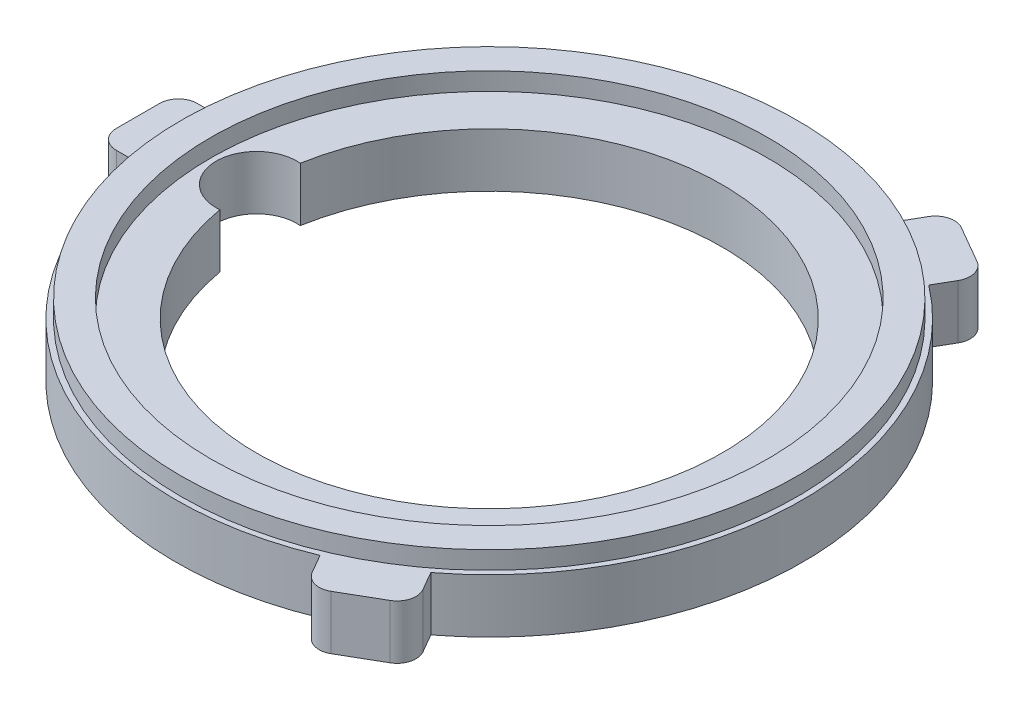
ISO-10303-21;
HEADER;
FILE_DESCRIPTION(('STEP AP214'),'2;1');
FILE_NAME('part.step','',(''),(''),'','','');
FILE_SCHEMA(('AUTOMOTIVE_DESIGN { 1 0 10303 214 1 1 1 1 }'));
ENDSEC;
DATA;
#1=APPLICATION_CONTEXT('core data for automotive mechanical design processes');
#2=APPLICATION_PROTOCOL_DEFINITION('international standard','automotive_design',2000,#1);
#3=PRODUCT_CONTEXT('',#1,'mechanical');
#4=PRODUCT('Part','Part','',(#3));
#5=PRODUCT_RELATED_PRODUCT_CATEGORY('part','',(#4));
#6=PRODUCT_DEFINITION_FORMATION('','',#4);
#7=PRODUCT_DEFINITION_CONTEXT('part definition',#1,'design');
#8=PRODUCT_DEFINITION('design','',#6,#7);
#9=PRODUCT_DEFINITION_SHAPE('','',#8);
#10=(LENGTH_UNIT() NAMED_UNIT(*) SI_UNIT(.MILLI.,.METRE.));
#11=(NAMED_UNIT(*) PLANE_ANGLE_UNIT() SI_UNIT($,.RADIAN.));
#12=(NAMED_UNIT(*) SI_UNIT($,.STERADIAN.) SOLID_ANGLE_UNIT());
#13=UNCERTAINTY_MEASURE_WITH_UNIT(LENGTH_MEASURE(1.E-05),#10,'distance_accuracy_value','');
#14=(GEOMETRIC_REPRESENTATION_CONTEXT(3) GLOBAL_UNCERTAINTY_ASSIGNED_CONTEXT((#13)) GLOBAL_UNIT_ASSIGNED_CONTEXT((#10,
#11,#12)) REPRESENTATION_CONTEXT('',''));
#15=CARTESIAN_POINT('',(0.,0.,0.));
#16=DIRECTION('',(0.,0.,1.));
#17=DIRECTION('',(1.,0.,0.));
#18=AXIS2_PLACEMENT_3D('',#15,#16,#17);
#19=CARTESIAN_POINT('',(0.,1.,0.));
#20=DIRECTION('',(0.,1.,0.));
#21=DIRECTION('',(0.,0.,1.));
#22=AXIS2_PLACEMENT_3D('',#19,#20,#21);
#23=PLANE('',#22);
#24=CARTESIAN_POINT('',(-4.30497406232469,1.,0.));
#25=DIRECTION('',(0.,1.,0.));
#26=DIRECTION('',(0.,0.,1.));
#27=AXIS2_PLACEMENT_3D('',#24,#25,#26);
#28=CIRCLE('',#27,0.747652736910806);
#29=CARTESIAN_POINT('',(-4.2400509516488,1.,-0.744828574042636));
#30=VERTEX_POINT('',#29);
#31=CARTESIAN_POINT('',(-4.2400509516488,1.,0.744828574042636));
#32=VERTEX_POINT('',#31);
#33=EDGE_CURVE('E228',#30,#32,#28,.T.);
#34=ORIENTED_EDGE('',*,*,#33,.F.);
#35=CARTESIAN_POINT('',(0.,1.,0.));
#36=DIRECTION('',(0.,1.,0.));
#37=DIRECTION('',(0.,0.,1.));
#38=AXIS2_PLACEMENT_3D('',#35,#36,#37);
#39=CIRCLE('',#38,4.30497406232469);
#40=EDGE_CURVE('E232',#32,#30,#39,.T.);
#41=ORIENTED_EDGE('',*,*,#40,.F.);
#42=EDGE_LOOP('',(#34,#41));
#43=FACE_BOUND('',#42,.T.);
#44=CARTESIAN_POINT('',(0.,1.,0.));
#45=DIRECTION('',(0.,1.,0.));
#46=DIRECTION('',(0.,0.,1.));
#47=AXIS2_PLACEMENT_3D('',#44,#45,#46);
#48=CIRCLE('',#47,5.1526268);
#49=CARTESIAN_POINT('',(0.,1.,5.1526268));
#50=VERTEX_POINT('',#49);
#51=EDGE_CURVE('E11',#50,#50,#48,.F.);
#52=ORIENTED_EDGE('',*,*,#51,.F.);
#53=EDGE_LOOP('',(#52));
#54=FACE_BOUND('',#53,.T.);
#55=ADVANCED_FACE('F33',(#43,#54),#23,.T.);
#56=CARTESIAN_POINT('',(0.,1.,0.));
#57=DIRECTION('',(0.,-1.,0.));
#58=DIRECTION('',(0.,0.,-1.));
#59=AXIS2_PLACEMENT_3D('',#56,#57,#58);
#60=CYLINDRICAL_SURFACE('',#59,5.8);
#61=DIRECTION('',(0.,-1.,0.));
#62=VECTOR('',#61,1.);
#63=CARTESIAN_POINT('',(2.22613304712086,1.,-5.35577554202156));
#64=LINE('',#63,#62);
#65=CARTESIAN_POINT('',(2.22613304712086,0.,-5.35577554202156));
#66=VERTEX_POINT('',#65);
#67=CARTESIAN_POINT('',(2.22613304712086,1.,-5.35577554202156));
#68=VERTEX_POINT('',#67);
#69=EDGE_CURVE('E177',#66,#68,#64,.F.);
#70=ORIENTED_EDGE('',*,*,#69,.F.);
#71=CARTESIAN_POINT('',(0.,0.,0.));
#72=DIRECTION('',(0.,1.,0.));
#73=DIRECTION('',(0.,0.,1.));
#74=AXIS2_PLACEMENT_3D('',#71,#72,#73);
#75=CIRCLE('',#74,5.8);
#76=CARTESIAN_POINT('',(-5.75130419991848,0.,-0.75));
#77=VERTEX_POINT('',#76);
#78=EDGE_CURVE('E185',#66,#77,#75,.T.);
#79=ORIENTED_EDGE('',*,*,#78,.T.);
#80=DIRECTION('',(0.,-1.,0.));
#81=VECTOR('',#80,1.);
#82=CARTESIAN_POINT('',(-5.75130419991848,1.,-0.75));
#83=LINE('',#82,#81);
#84=CARTESIAN_POINT('',(-5.75130419991848,1.,-0.75));
#85=VERTEX_POINT('',#84);
#86=EDGE_CURVE('E246',#77,#85,#83,.F.);
#87=ORIENTED_EDGE('',*,*,#86,.T.);
#88=CARTESIAN_POINT('',(0.,1.,0.));
#89=DIRECTION('',(0.,1.,0.));
#90=DIRECTION('',(0.,0.,1.));
#91=AXIS2_PLACEMENT_3D('',#88,#89,#90);
#92=CIRCLE('',#91,5.8);
#93=EDGE_CURVE('E201',#68,#85,#92,.T.);
#94=ORIENTED_EDGE('',*,*,#93,.F.);
#95=EDGE_LOOP('',(#70,#79,#87,#94));
#96=FACE_BOUND('',#95,.T.);
#97=ADVANCED_FACE('F199',(#96),#60,.T.);
#98=CARTESIAN_POINT('',(3.52517115279759,0.,4.60577554202153));
#99=VERTEX_POINT('',#98);
#100=CARTESIAN_POINT('',(3.52517115279753,0.,-4.60577554202158));
#101=VERTEX_POINT('',#100);
#102=EDGE_CURVE('E194',#99,#101,#75,.T.);
#103=ORIENTED_EDGE('',*,*,#102,.T.);
#104=DIRECTION('',(0.,-1.,0.));
#105=VECTOR('',#104,1.);
#106=CARTESIAN_POINT('',(3.52517115279753,1.,-4.60577554202158));
#107=LINE('',#106,#105);
#108=CARTESIAN_POINT('',(3.52517115279753,1.,-4.60577554202158));
#109=VERTEX_POINT('',#108);
#110=EDGE_CURVE('E203',#101,#109,#107,.F.);
#111=ORIENTED_EDGE('',*,*,#110,.T.);
#112=CARTESIAN_POINT('',(3.52517115279759,1.,4.60577554202153));
#113=VERTEX_POINT('',#112);
#114=EDGE_CURVE('E258',#113,#109,#92,.T.);
#115=ORIENTED_EDGE('',*,*,#114,.F.);
#116=DIRECTION('',(0.,-1.,0.));
#117=VECTOR('',#116,1.);
#118=CARTESIAN_POINT('',(3.52517115279759,1.,4.60577554202153));
#119=LINE('',#118,#117);
#120=EDGE_CURVE('E225',#99,#113,#119,.F.);
#121=ORIENTED_EDGE('',*,*,#120,.F.);
#122=EDGE_LOOP('',(#103,#111,#115,#121));
#123=FACE_BOUND('',#122,.T.);
#124=ADVANCED_FACE('F364',(#123),#60,.T.);
#125=CARTESIAN_POINT('',(-5.75130419991848,0.,0.75));
#126=VERTEX_POINT('',#125);
#127=CARTESIAN_POINT('',(2.22613304712094,0.,5.35577554202153));
#128=VERTEX_POINT('',#127);
#129=EDGE_CURVE('E197',#126,#128,#75,.T.);
#130=ORIENTED_EDGE('',*,*,#129,.T.);
#131=DIRECTION('',(0.,-1.,0.));
#132=VECTOR('',#131,1.);
#133=CARTESIAN_POINT('',(2.22613304712094,1.,5.35577554202153));
#134=LINE('',#133,#132);
#135=CARTESIAN_POINT('',(2.22613304712094,1.,5.35577554202153));
#136=VERTEX_POINT('',#135);
#137=EDGE_CURVE('E219',#128,#136,#134,.F.);
#138=ORIENTED_EDGE('',*,*,#137,.T.);
#139=CARTESIAN_POINT('',(-5.75130419991848,1.,0.75));
#140=VERTEX_POINT('',#139);
#141=EDGE_CURVE('E255',#140,#136,#92,.T.);
#142=ORIENTED_EDGE('',*,*,#141,.F.);
#143=DIRECTION('',(0.,-1.,0.));
#144=VECTOR('',#143,1.);
#145=CARTESIAN_POINT('',(-5.75130419991848,1.,0.75));
#146=LINE('',#145,#144);
#147=EDGE_CURVE('E195',#126,#140,#146,.F.);
#148=ORIENTED_EDGE('',*,*,#147,.F.);
#149=EDGE_LOOP('',(#130,#138,#142,#148));
#150=FACE_BOUND('',#149,.T.);
#151=ADVANCED_FACE('F337',(#150),#60,.T.);
#152=CARTESIAN_POINT('',(0.,1.,0.));
#153=DIRECTION('',(0.,1.,0.));
#154=DIRECTION('',(0.,0.,1.));
#155=AXIS2_PLACEMENT_3D('',#152,#153,#154);
#156=CIRCLE('',#155,5.7);
#157=CARTESIAN_POINT('',(0.,1.,5.7));
#158=VERTEX_POINT('',#157);
#159=EDGE_CURVE('E383',#158,#158,#156,.T.);
#160=ORIENTED_EDGE('',*,*,#159,.F.);
#161=EDGE_LOOP('',(#160));
#162=FACE_BOUND('',#161,.T.);
#163=DIRECTION('',(-0.500000000000004,0.,-0.866025403784436));
#164=VECTOR('',#163,1.);
#165=CARTESIAN_POINT('',(2.6004809471617,1.,6.00416512459884));
#166=LINE('',#165,#164);
#167=CARTESIAN_POINT('',(2.4254809471617,1.,5.70105623327429));
#168=VERTEX_POINT('',#167);
#169=EDGE_CURVE('E218',#168,#136,#166,.T.);
#170=ORIENTED_EDGE('',*,*,#169,.F.);
#171=CARTESIAN_POINT('',(2.72858983848625,1.,5.52605623327429));
#172=DIRECTION('',(0.,1.,0.));
#173=DIRECTION('',(0.,0.,1.));
#174=AXIS2_PLACEMENT_3D('',#171,#172,#173);
#175=CIRCLE('',#174,0.35);
#176=CARTESIAN_POINT('',(2.90358983848625,1.,5.82916512459884));
#177=VERTEX_POINT('',#176);
#178=EDGE_CURVE('E293',#168,#177,#175,.T.);
#179=ORIENTED_EDGE('',*,*,#178,.T.);
#180=DIRECTION('',(0.866025403784436,0.,-0.500000000000004));
#181=VECTOR('',#180,1.);
#182=CARTESIAN_POINT('',(2.6004809471617,1.,6.00416512459884));
#183=LINE('',#182,#181);
#184=CARTESIAN_POINT('',(3.5964101615138,1.,5.42916512459884));
#185=VERTEX_POINT('',#184);
#186=EDGE_CURVE('E213',#177,#185,#183,.T.);
#187=ORIENTED_EDGE('',*,*,#186,.T.);
#188=CARTESIAN_POINT('',(3.4214101615138,1.,5.12605623327428));
#189=DIRECTION('',(0.,1.,0.));
#190=DIRECTION('',(0.,0.,1.));
#191=AXIS2_PLACEMENT_3D('',#188,#189,#190);
#192=CIRCLE('',#191,0.35);
#193=CARTESIAN_POINT('',(3.72451905283835,1.,4.95105623327428));
#194=VERTEX_POINT('',#193);
#195=EDGE_CURVE('E48',#185,#194,#192,.T.);
#196=ORIENTED_EDGE('',*,*,#195,.T.);
#197=DIRECTION('',(-0.500000000000004,0.,-0.866025403784436));
#198=VECTOR('',#197,1.);
#199=CARTESIAN_POINT('',(3.89951905283835,1.,5.25416512459883));
#200=LINE('',#199,#198);
#201=EDGE_CURVE('E215',#194,#113,#200,.T.);
#202=ORIENTED_EDGE('',*,*,#201,.T.);
#203=ORIENTED_EDGE('',*,*,#114,.T.);
#204=DIRECTION('',(-0.499999999999992,0.,0.866025403784443));
#205=VECTOR('',#204,1.);
#206=CARTESIAN_POINT('',(3.89951905283828,1.,-5.25416512459889));
#207=LINE('',#206,#205);
#208=CARTESIAN_POINT('',(3.72451905283828,1.,-4.95105623327433));
#209=VERTEX_POINT('',#208);
#210=EDGE_CURVE('E209',#209,#109,#207,.T.);
#211=ORIENTED_EDGE('',*,*,#210,.F.);
#212=CARTESIAN_POINT('',(3.42141016151373,1.,-5.12605623327433));
#213=DIRECTION('',(0.,1.,0.));
#214=DIRECTION('',(0.,0.,1.));
#215=AXIS2_PLACEMENT_3D('',#212,#213,#214);
#216=CIRCLE('',#215,0.35);
#217=CARTESIAN_POINT('',(3.59641016151373,1.,-5.42916512459888));
#218=VERTEX_POINT('',#217);
#219=EDGE_CURVE('E290',#209,#218,#216,.T.);
#220=ORIENTED_EDGE('',*,*,#219,.T.);
#221=DIRECTION('',(-0.866025403784443,0.,-0.499999999999992));
#222=VECTOR('',#221,1.);
#223=CARTESIAN_POINT('',(3.89951905283828,1.,-5.25416512459889));
#224=LINE('',#223,#222);
#225=CARTESIAN_POINT('',(2.90358983848617,1.,-5.82916512459888));
#226=VERTEX_POINT('',#225);
#227=EDGE_CURVE('E373',#218,#226,#224,.T.);
#228=ORIENTED_EDGE('',*,*,#227,.T.);
#229=CARTESIAN_POINT('',(2.72858983848617,1.,-5.52605623327432));
#230=DIRECTION('',(0.,1.,0.));
#231=DIRECTION('',(0.,0.,1.));
#232=AXIS2_PLACEMENT_3D('',#229,#230,#231);
#233=CIRCLE('',#232,0.35);
#234=CARTESIAN_POINT('',(2.42548094716162,1.,-5.70105623327432));
#235=VERTEX_POINT('',#234);
#236=EDGE_CURVE('E288',#226,#235,#233,.T.);
#237=ORIENTED_EDGE('',*,*,#236,.T.);
#238=DIRECTION('',(-0.499999999999992,0.,0.866025403784443));
#239=VECTOR('',#238,1.);
#240=CARTESIAN_POINT('',(2.60048094716162,1.,-6.00416512459888));
#241=LINE('',#240,#239);
#242=EDGE_CURVE('E371',#235,#68,#241,.T.);
#243=ORIENTED_EDGE('',*,*,#242,.T.);
#244=ORIENTED_EDGE('',*,*,#93,.T.);
#245=DIRECTION('',(1.,0.,0.));
#246=VECTOR('',#245,1.);
#247=CARTESIAN_POINT('',(-6.5,1.,-0.75));
#248=LINE('',#247,#246);
#249=CARTESIAN_POINT('',(-6.15,1.,-0.75));
#250=VERTEX_POINT('',#249);
#251=EDGE_CURVE('E244',#250,#85,#248,.T.);
#252=ORIENTED_EDGE('',*,*,#251,.F.);
#253=CARTESIAN_POINT('',(-6.15,1.,-0.4));
#254=DIRECTION('',(0.,1.,0.));
#255=DIRECTION('',(0.,0.,1.));
#256=AXIS2_PLACEMENT_3D('',#253,#254,#255);
#257=CIRCLE('',#256,0.35);
#258=CARTESIAN_POINT('',(-6.5,1.,-0.4));
#259=VERTEX_POINT('',#258);
#260=EDGE_CURVE('E285',#250,#259,#257,.T.);
#261=ORIENTED_EDGE('',*,*,#260,.T.);
#262=DIRECTION('',(0.,0.,1.));
#263=VECTOR('',#262,1.);
#264=CARTESIAN_POINT('',(-6.5,1.,-0.75));
#265=LINE('',#264,#263);
#266=CARTESIAN_POINT('',(-6.5,1.,0.4));
#267=VERTEX_POINT('',#266);
#268=EDGE_CURVE('E240',#259,#267,#265,.T.);
#269=ORIENTED_EDGE('',*,*,#268,.T.);
#270=CARTESIAN_POINT('',(-6.15,1.,0.4));
#271=DIRECTION('',(0.,1.,0.));
#272=DIRECTION('',(0.,0.,1.));
#273=AXIS2_PLACEMENT_3D('',#270,#271,#272);
#274=CIRCLE('',#273,0.35);
#275=CARTESIAN_POINT('',(-6.15,1.,0.75));
#276=VERTEX_POINT('',#275);
#277=EDGE_CURVE('E55',#267,#276,#274,.T.);
#278=ORIENTED_EDGE('',*,*,#277,.T.);
#279=DIRECTION('',(1.,0.,0.));
#280=VECTOR('',#279,1.);
#281=CARTESIAN_POINT('',(-6.5,1.,0.75));
#282=LINE('',#281,#280);
#283=EDGE_CURVE('E242',#276,#140,#282,.T.);
#284=ORIENTED_EDGE('',*,*,#283,.T.);
#285=ORIENTED_EDGE('',*,*,#141,.T.);
#286=EDGE_LOOP('',(#170,#179,#187,#196,#202,#203,#211,#220,#228,#237,#243,#244,#252,#261,#269,
#278,#284,#285));
#287=FACE_BOUND('',#286,.T.);
#288=ADVANCED_FACE('F320',(#162,#287),#23,.T.);
#289=CARTESIAN_POINT('',(0.,0.,0.));
#290=DIRECTION('',(0.,1.,0.));
#291=DIRECTION('',(0.,0.,1.));
#292=AXIS2_PLACEMENT_3D('',#289,#290,#291);
#293=PLANE('',#292);
#294=DIRECTION('',(0.866025403784436,0.,-0.500000000000004));
#295=VECTOR('',#294,1.);
#296=CARTESIAN_POINT('',(2.6004809471617,0.,6.00416512459884));
#297=LINE('',#296,#295);
#298=CARTESIAN_POINT('',(2.90358983848625,0.,5.82916512459884));
#299=VERTEX_POINT('',#298);
#300=CARTESIAN_POINT('',(3.5964101615138,0.,5.42916512459884));
#301=VERTEX_POINT('',#300);
#302=EDGE_CURVE('E202',#299,#301,#297,.T.);
#303=ORIENTED_EDGE('',*,*,#302,.F.);
#304=CARTESIAN_POINT('',(2.72858983848625,0.,5.52605623327429));
#305=DIRECTION('',(0.,1.,0.));
#306=DIRECTION('',(0.,0.,1.));
#307=AXIS2_PLACEMENT_3D('',#304,#305,#306);
#308=CIRCLE('',#307,0.35);
#309=CARTESIAN_POINT('',(2.4254809471617,0.,5.70105623327429));
#310=VERTEX_POINT('',#309);
#311=EDGE_CURVE('E281',#299,#310,#308,.F.);
#312=ORIENTED_EDGE('',*,*,#311,.T.);
#313=DIRECTION('',(-0.500000000000004,0.,-0.866025403784436));
#314=VECTOR('',#313,1.);
#315=CARTESIAN_POINT('',(2.6004809471617,0.,6.00416512459884));
#316=LINE('',#315,#314);
#317=EDGE_CURVE('E216',#310,#128,#316,.T.);
#318=ORIENTED_EDGE('',*,*,#317,.T.);
#319=ORIENTED_EDGE('',*,*,#129,.F.);
#320=DIRECTION('',(1.,0.,0.));
#321=VECTOR('',#320,1.);
#322=CARTESIAN_POINT('',(-6.5,0.,0.75));
#323=LINE('',#322,#321);
#324=CARTESIAN_POINT('',(-6.15,0.,0.75));
#325=VERTEX_POINT('',#324);
#326=EDGE_CURVE('E249',#325,#126,#323,.T.);
#327=ORIENTED_EDGE('',*,*,#326,.F.);
#328=CARTESIAN_POINT('',(-6.15,0.,0.4));
#329=DIRECTION('',(0.,1.,0.));
#330=DIRECTION('',(0.,0.,1.));
#331=AXIS2_PLACEMENT_3D('',#328,#329,#330);
#332=CIRCLE('',#331,0.35);
#333=CARTESIAN_POINT('',(-6.5,0.,0.4));
#334=VERTEX_POINT('',#333);
#335=EDGE_CURVE('E273',#325,#334,#332,.F.);
#336=ORIENTED_EDGE('',*,*,#335,.T.);
#337=DIRECTION('',(0.,0.,1.));
#338=VECTOR('',#337,1.);
#339=CARTESIAN_POINT('',(-6.5,0.,-0.75));
#340=LINE('',#339,#338);
#341=CARTESIAN_POINT('',(-6.5,0.,-0.4));
#342=VERTEX_POINT('',#341);
#343=EDGE_CURVE('E237',#342,#334,#340,.T.);
#344=ORIENTED_EDGE('',*,*,#343,.F.);
#345=CARTESIAN_POINT('',(-6.15,0.,-0.4));
#346=DIRECTION('',(0.,1.,0.));
#347=DIRECTION('',(0.,0.,1.));
#348=AXIS2_PLACEMENT_3D('',#345,#346,#347);
#349=CIRCLE('',#348,0.35);
#350=CARTESIAN_POINT('',(-6.15,0.,-0.75));
#351=VERTEX_POINT('',#350);
#352=EDGE_CURVE('E271',#342,#351,#349,.F.);
#353=ORIENTED_EDGE('',*,*,#352,.T.);
#354=DIRECTION('',(1.,0.,0.));
#355=VECTOR('',#354,1.);
#356=CARTESIAN_POINT('',(-6.5,0.,-0.75));
#357=LINE('',#356,#355);
#358=EDGE_CURVE('E190',#351,#77,#357,.T.);
#359=ORIENTED_EDGE('',*,*,#358,.T.);
#360=ORIENTED_EDGE('',*,*,#78,.F.);
#361=DIRECTION('',(-0.499999999999992,0.,0.866025403784443));
#362=VECTOR('',#361,1.);
#363=CARTESIAN_POINT('',(2.60048094716162,0.,-6.00416512459888));
#364=LINE('',#363,#362);
#365=CARTESIAN_POINT('',(2.42548094716162,0.,-5.70105623327432));
#366=VERTEX_POINT('',#365);
#367=EDGE_CURVE('E172',#366,#66,#364,.T.);
#368=ORIENTED_EDGE('',*,*,#367,.F.);
#369=CARTESIAN_POINT('',(2.72858983848617,0.,-5.52605623327432));
#370=DIRECTION('',(0.,1.,0.));
#371=DIRECTION('',(0.,0.,1.));
#372=AXIS2_PLACEMENT_3D('',#369,#370,#371);
#373=CIRCLE('',#372,0.35);
#374=CARTESIAN_POINT('',(2.90358983848617,0.,-5.82916512459888));
#375=VERTEX_POINT('',#374);
#376=EDGE_CURVE('E275',#366,#375,#373,.F.);
#377=ORIENTED_EDGE('',*,*,#376,.T.);
#378=DIRECTION('',(-0.866025403784443,0.,-0.499999999999992));
#379=VECTOR('',#378,1.);
#380=CARTESIAN_POINT('',(3.89951905283828,0.,-5.25416512459889));
#381=LINE('',#380,#379);
#382=CARTESIAN_POINT('',(3.59641016151373,0.,-5.42916512459888));
#383=VERTEX_POINT('',#382);
#384=EDGE_CURVE('E182',#383,#375,#381,.T.);
#385=ORIENTED_EDGE('',*,*,#384,.F.);
#386=CARTESIAN_POINT('',(3.42141016151373,0.,-5.12605623327433));
#387=DIRECTION('',(0.,1.,0.));
#388=DIRECTION('',(0.,0.,1.));
#389=AXIS2_PLACEMENT_3D('',#386,#387,#388);
#390=CIRCLE('',#389,0.35);
#391=CARTESIAN_POINT('',(3.72451905283828,0.,-4.95105623327433));
#392=VERTEX_POINT('',#391);
#393=EDGE_CURVE('E277',#383,#392,#390,.F.);
#394=ORIENTED_EDGE('',*,*,#393,.T.);
#395=DIRECTION('',(-0.499999999999992,0.,0.866025403784443));
#396=VECTOR('',#395,1.);
#397=CARTESIAN_POINT('',(3.89951905283828,0.,-5.25416512459889));
#398=LINE('',#397,#396);
#399=EDGE_CURVE('E181',#392,#101,#398,.T.);
#400=ORIENTED_EDGE('',*,*,#399,.T.);
#401=ORIENTED_EDGE('',*,*,#102,.F.);
#402=DIRECTION('',(-0.500000000000004,0.,-0.866025403784436));
#403=VECTOR('',#402,1.);
#404=CARTESIAN_POINT('',(3.89951905283835,0.,5.25416512459883));
#405=LINE('',#404,#403);
#406=CARTESIAN_POINT('',(3.72451905283835,0.,4.95105623327428));
#407=VERTEX_POINT('',#406);
#408=EDGE_CURVE('E206',#407,#99,#405,.T.);
#409=ORIENTED_EDGE('',*,*,#408,.F.);
#410=CARTESIAN_POINT('',(3.4214101615138,0.,5.12605623327428));
#411=DIRECTION('',(0.,1.,0.));
#412=DIRECTION('',(0.,0.,1.));
#413=AXIS2_PLACEMENT_3D('',#410,#411,#412);
#414=CIRCLE('',#413,0.35);
#415=EDGE_CURVE('E279',#407,#301,#414,.F.);
#416=ORIENTED_EDGE('',*,*,#415,.T.);
#417=EDGE_LOOP('',(#303,#312,#318,#319,#327,#336,#344,#353,#359,#360,#368,#377,#385,#394,#400,
#401,#409,#416));
#418=FACE_BOUND('',#417,.T.);
#419=CARTESIAN_POINT('',(0.,0.,0.));
#420=DIRECTION('',(0.,1.,0.));
#421=DIRECTION('',(0.,0.,1.));
#422=AXIS2_PLACEMENT_3D('',#419,#420,#421);
#423=CIRCLE('',#422,4.30497406232469);
#424=CARTESIAN_POINT('',(-4.2400509516488,0.,0.744828574042636));
#425=VERTEX_POINT('',#424);
#426=CARTESIAN_POINT('',(-4.2400509516488,0.,-0.744828574042636));
#427=VERTEX_POINT('',#426);
#428=EDGE_CURVE('E234',#425,#427,#423,.T.);
#429=ORIENTED_EDGE('',*,*,#428,.T.);
#430=CARTESIAN_POINT('',(-4.30497406232469,0.,0.));
#431=DIRECTION('',(0.,1.,0.));
#432=DIRECTION('',(0.,0.,1.));
#433=AXIS2_PLACEMENT_3D('',#430,#431,#432);
#434=CIRCLE('',#433,0.747652736910806);
#435=EDGE_CURVE('E229',#427,#425,#434,.T.);
#436=ORIENTED_EDGE('',*,*,#435,.T.);
#437=EDGE_LOOP('',(#429,#436));
#438=FACE_BOUND('',#437,.T.);
#439=ADVANCED_FACE('F187',(#418,#438),#293,.F.);
#440=CARTESIAN_POINT('',(-6.5,1.,0.75));
#441=DIRECTION('',(0.,0.,-1.));
#442=DIRECTION('',(-1.,0.,0.));
#443=AXIS2_PLACEMENT_3D('',#440,#441,#442);
#444=PLANE('',#443);
#445=ORIENTED_EDGE('',*,*,#283,.F.);
#446=DIRECTION('',(0.,-1.,0.));
#447=VECTOR('',#446,1.);
#448=CARTESIAN_POINT('',(-6.15,1.,0.75));
#449=LINE('',#448,#447);
#450=EDGE_CURVE('E306',#276,#325,#449,.T.);
#451=ORIENTED_EDGE('',*,*,#450,.T.);
#452=ORIENTED_EDGE('',*,*,#326,.T.);
#453=ORIENTED_EDGE('',*,*,#147,.T.);
#454=EDGE_LOOP('',(#445,#451,#452,#453));
#455=FACE_BOUND('',#454,.T.);
#456=ADVANCED_FACE('F333',(#455),#444,.F.);
#457=CARTESIAN_POINT('',(-6.5,1.,-0.75));
#458=DIRECTION('',(0.,0.,-1.));
#459=DIRECTION('',(-1.,0.,0.));
#460=AXIS2_PLACEMENT_3D('',#457,#458,#459);
#461=PLANE('',#460);
#462=ORIENTED_EDGE('',*,*,#358,.F.);
#463=DIRECTION('',(0.,-1.,0.));
#464=VECTOR('',#463,1.);
#465=CARTESIAN_POINT('',(-6.15,1.,-0.75));
#466=LINE('',#465,#464);
#467=EDGE_CURVE('E41',#351,#250,#466,.F.);
#468=ORIENTED_EDGE('',*,*,#467,.T.);
#469=ORIENTED_EDGE('',*,*,#251,.T.);
#470=ORIENTED_EDGE('',*,*,#86,.F.);
#471=EDGE_LOOP('',(#462,#468,#469,#470));
#472=FACE_BOUND('',#471,.T.);
#473=ADVANCED_FACE('F316',(#472),#461,.T.);
#474=CARTESIAN_POINT('',(-6.5,1.,-0.75));
#475=DIRECTION('',(1.,0.,0.));
#476=DIRECTION('',(0.,0.,-1.));
#477=AXIS2_PLACEMENT_3D('',#474,#475,#476);
#478=PLANE('',#477);
#479=ORIENTED_EDGE('',*,*,#343,.T.);
#480=DIRECTION('',(0.,-1.,0.));
#481=VECTOR('',#480,1.);
#482=CARTESIAN_POINT('',(-6.5,1.,0.4));
#483=LINE('',#482,#481);
#484=EDGE_CURVE('E312',#334,#267,#483,.F.);
#485=ORIENTED_EDGE('',*,*,#484,.T.);
#486=ORIENTED_EDGE('',*,*,#268,.F.);
#487=DIRECTION('',(0.,-1.,0.));
#488=VECTOR('',#487,1.);
#489=CARTESIAN_POINT('',(-6.5,0.,-0.4));
#490=LINE('',#489,#488);
#491=EDGE_CURVE('E309',#259,#342,#490,.T.);
#492=ORIENTED_EDGE('',*,*,#491,.T.);
#493=EDGE_LOOP('',(#479,#485,#486,#492));
#494=FACE_BOUND('',#493,.T.);
#495=ADVANCED_FACE('F325',(#494),#478,.F.);
#496=CARTESIAN_POINT('',(0.,0.,0.));
#497=DIRECTION('',(0.,1.,0.));
#498=DIRECTION('',(0.,0.,1.));
#499=AXIS2_PLACEMENT_3D('',#496,#497,#498);
#500=CYLINDRICAL_SURFACE('',#499,4.30497406232469);
#501=ORIENTED_EDGE('',*,*,#428,.F.);
#502=DIRECTION('',(0.,1.,0.));
#503=VECTOR('',#502,1.);
#504=CARTESIAN_POINT('',(-4.2400509516488,0.5,0.744828574042636));
#505=LINE('',#504,#503);
#506=EDGE_CURVE('E263',#425,#32,#505,.T.);
#507=ORIENTED_EDGE('',*,*,#506,.T.);
#508=ORIENTED_EDGE('',*,*,#40,.T.);
#509=DIRECTION('',(0.,1.,0.));
#510=VECTOR('',#509,1.);
#511=CARTESIAN_POINT('',(-4.2400509516488,0.5,-0.744828574042636));
#512=LINE('',#511,#510);
#513=EDGE_CURVE('E257',#30,#427,#512,.F.);
#514=ORIENTED_EDGE('',*,*,#513,.T.);
#515=EDGE_LOOP('',(#501,#507,#508,#514));
#516=FACE_BOUND('',#515,.T.);
#517=ADVANCED_FACE('F563',(#516),#500,.F.);
#518=CARTESIAN_POINT('',(-4.30497406232469,0.,0.));
#519=DIRECTION('',(0.,1.,0.));
#520=DIRECTION('',(0.,0.,1.));
#521=AXIS2_PLACEMENT_3D('',#518,#519,#520);
#522=CYLINDRICAL_SURFACE('',#521,0.747652736910806);
#523=ORIENTED_EDGE('',*,*,#435,.F.);
#524=ORIENTED_EDGE('',*,*,#513,.F.);
#525=ORIENTED_EDGE('',*,*,#33,.T.);
#526=ORIENTED_EDGE('',*,*,#506,.F.);
#527=EDGE_LOOP('',(#523,#524,#525,#526));
#528=FACE_BOUND('',#527,.T.);
#529=ADVANCED_FACE('F527',(#528),#522,.F.);
#530=CARTESIAN_POINT('',(3.89951905283835,1.,5.25416512459883));
#531=DIRECTION('',(-0.866025403784436,0.,0.500000000000004));
#532=DIRECTION('',(0.500000000000004,0.,0.866025403784436));
#533=AXIS2_PLACEMENT_3D('',#530,#531,#532);
#534=PLANE('',#533);
#535=ORIENTED_EDGE('',*,*,#201,.F.);
#536=DIRECTION('',(0.,-1.,0.));
#537=VECTOR('',#536,1.);
#538=CARTESIAN_POINT('',(3.72451905283835,1.,4.95105623327428));
#539=LINE('',#538,#537);
#540=EDGE_CURVE('E295',#194,#407,#539,.T.);
#541=ORIENTED_EDGE('',*,*,#540,.T.);
#542=ORIENTED_EDGE('',*,*,#408,.T.);
#543=ORIENTED_EDGE('',*,*,#120,.T.);
#544=EDGE_LOOP('',(#535,#541,#542,#543));
#545=FACE_BOUND('',#544,.T.);
#546=ADVANCED_FACE('F357',(#545),#534,.F.);
#547=CARTESIAN_POINT('',(2.6004809471617,1.,6.00416512459884));
#548=DIRECTION('',(-0.866025403784436,0.,0.500000000000004));
#549=DIRECTION('',(0.500000000000004,0.,0.866025403784436));
#550=AXIS2_PLACEMENT_3D('',#547,#548,#549);
#551=PLANE('',#550);
#552=ORIENTED_EDGE('',*,*,#317,.F.);
#553=DIRECTION('',(0.,-1.,0.));
#554=VECTOR('',#553,1.);
#555=CARTESIAN_POINT('',(2.4254809471617,1.,5.70105623327429));
#556=LINE('',#555,#554);
#557=EDGE_CURVE('E283',#310,#168,#556,.F.);
#558=ORIENTED_EDGE('',*,*,#557,.T.);
#559=ORIENTED_EDGE('',*,*,#169,.T.);
#560=ORIENTED_EDGE('',*,*,#137,.F.);
#561=EDGE_LOOP('',(#552,#558,#559,#560));
#562=FACE_BOUND('',#561,.T.);
#563=ADVANCED_FACE('F341',(#562),#551,.T.);
#564=CARTESIAN_POINT('',(2.6004809471617,1.,6.00416512459884));
#565=DIRECTION('',(-0.500000000000004,0.,-0.866025403784436));
#566=DIRECTION('',(-0.866025403784436,0.,0.500000000000004));
#567=AXIS2_PLACEMENT_3D('',#564,#565,#566);
#568=PLANE('',#567);
#569=ORIENTED_EDGE('',*,*,#186,.F.);
#570=DIRECTION('',(0.,-1.,0.));
#571=VECTOR('',#570,1.);
#572=CARTESIAN_POINT('',(2.90358983848625,0.,5.82916512459884));
#573=LINE('',#572,#571);
#574=EDGE_CURVE('E268',#177,#299,#573,.T.);
#575=ORIENTED_EDGE('',*,*,#574,.T.);
#576=ORIENTED_EDGE('',*,*,#302,.T.);
#577=DIRECTION('',(0.,-1.,0.));
#578=VECTOR('',#577,1.);
#579=CARTESIAN_POINT('',(3.5964101615138,1.,5.42916512459884));
#580=LINE('',#579,#578);
#581=EDGE_CURVE('E266',#301,#185,#580,.F.);
#582=ORIENTED_EDGE('',*,*,#581,.T.);
#583=EDGE_LOOP('',(#569,#575,#576,#582));
#584=FACE_BOUND('',#583,.T.);
#585=ADVANCED_FACE('F349',(#584),#568,.F.);
#586=CARTESIAN_POINT('',(2.60048094716162,1.,-6.00416512459888));
#587=DIRECTION('',(0.866025403784443,0.,0.499999999999992));
#588=DIRECTION('',(0.499999999999992,0.,-0.866025403784443));
#589=AXIS2_PLACEMENT_3D('',#586,#587,#588);
#590=PLANE('',#589);
#591=ORIENTED_EDGE('',*,*,#242,.F.);
#592=DIRECTION('',(0.,-1.,0.));
#593=VECTOR('',#592,1.);
#594=CARTESIAN_POINT('',(2.42548094716162,1.,-5.70105623327432));
#595=LINE('',#594,#593);
#596=EDGE_CURVE('E179',#235,#366,#595,.T.);
#597=ORIENTED_EDGE('',*,*,#596,.T.);
#598=ORIENTED_EDGE('',*,*,#367,.T.);
#599=ORIENTED_EDGE('',*,*,#69,.T.);
#600=EDGE_LOOP('',(#591,#597,#598,#599));
#601=FACE_BOUND('',#600,.T.);
#602=ADVANCED_FACE('F175',(#601),#590,.F.);
#603=CARTESIAN_POINT('',(3.89951905283828,1.,-5.25416512459889));
#604=DIRECTION('',(0.866025403784443,0.,0.499999999999992));
#605=DIRECTION('',(0.499999999999992,0.,-0.866025403784443));
#606=AXIS2_PLACEMENT_3D('',#603,#604,#605);
#607=PLANE('',#606);
#608=ORIENTED_EDGE('',*,*,#399,.F.);
#609=DIRECTION('',(0.,-1.,0.));
#610=VECTOR('',#609,1.);
#611=CARTESIAN_POINT('',(3.72451905283828,1.,-4.95105623327433));
#612=LINE('',#611,#610);
#613=EDGE_CURVE('E303',#392,#209,#612,.F.);
#614=ORIENTED_EDGE('',*,*,#613,.T.);
#615=ORIENTED_EDGE('',*,*,#210,.T.);
#616=ORIENTED_EDGE('',*,*,#110,.F.);
#617=EDGE_LOOP('',(#608,#614,#615,#616));
#618=FACE_BOUND('',#617,.T.);
#619=ADVANCED_FACE('F368',(#618),#607,.T.);
#620=CARTESIAN_POINT('',(3.89951905283828,1.,-5.25416512459889));
#621=DIRECTION('',(-0.499999999999992,0.,0.866025403784443));
#622=DIRECTION('',(0.866025403784443,0.,0.499999999999992));
#623=AXIS2_PLACEMENT_3D('',#620,#621,#622);
#624=PLANE('',#623);
#625=ORIENTED_EDGE('',*,*,#227,.F.);
#626=DIRECTION('',(0.,-1.,0.));
#627=VECTOR('',#626,1.);
#628=CARTESIAN_POINT('',(3.59641016151373,0.,-5.42916512459888));
#629=LINE('',#628,#627);
#630=EDGE_CURVE('E300',#218,#383,#629,.T.);
#631=ORIENTED_EDGE('',*,*,#630,.T.);
#632=ORIENTED_EDGE('',*,*,#384,.T.);
#633=DIRECTION('',(0.,-1.,0.));
#634=VECTOR('',#633,1.);
#635=CARTESIAN_POINT('',(2.90358983848617,1.,-5.82916512459888));
#636=LINE('',#635,#634);
#637=EDGE_CURVE('E298',#375,#226,#636,.F.);
#638=ORIENTED_EDGE('',*,*,#637,.T.);
#639=EDGE_LOOP('',(#625,#631,#632,#638));
#640=FACE_BOUND('',#639,.T.);
#641=ADVANCED_FACE('F434',(#640),#624,.F.);
#642=CARTESIAN_POINT('',(2.72858983848625,1.,5.52605623327429));
#643=DIRECTION('',(0.,1.,0.));
#644=DIRECTION('',(0.,0.,1.));
#645=AXIS2_PLACEMENT_3D('',#642,#643,#644);
#646=CYLINDRICAL_SURFACE('',#645,0.35);
#647=ORIENTED_EDGE('',*,*,#178,.F.);
#648=ORIENTED_EDGE('',*,*,#557,.F.);
#649=ORIENTED_EDGE('',*,*,#311,.F.);
#650=ORIENTED_EDGE('',*,*,#574,.F.);
#651=EDGE_LOOP('',(#647,#648,#649,#650));
#652=FACE_BOUND('',#651,.T.);
#653=ADVANCED_FACE('F347',(#652),#646,.T.);
#654=CARTESIAN_POINT('',(3.4214101615138,1.,5.12605623327428));
#655=DIRECTION('',(0.,-1.,0.));
#656=DIRECTION('',(0.,0.,-1.));
#657=AXIS2_PLACEMENT_3D('',#654,#655,#656);
#658=CYLINDRICAL_SURFACE('',#657,0.35);
#659=ORIENTED_EDGE('',*,*,#195,.F.);
#660=ORIENTED_EDGE('',*,*,#581,.F.);
#661=ORIENTED_EDGE('',*,*,#415,.F.);
#662=ORIENTED_EDGE('',*,*,#540,.F.);
#663=EDGE_LOOP('',(#659,#660,#661,#662));
#664=FACE_BOUND('',#663,.T.);
#665=ADVANCED_FACE('F355',(#664),#658,.T.);
#666=CARTESIAN_POINT('',(3.42141016151373,1.,-5.12605623327433));
#667=DIRECTION('',(0.,1.,0.));
#668=DIRECTION('',(0.,0.,1.));
#669=AXIS2_PLACEMENT_3D('',#666,#667,#668);
#670=CYLINDRICAL_SURFACE('',#669,0.35);
#671=ORIENTED_EDGE('',*,*,#219,.F.);
#672=ORIENTED_EDGE('',*,*,#613,.F.);
#673=ORIENTED_EDGE('',*,*,#393,.F.);
#674=ORIENTED_EDGE('',*,*,#630,.F.);
#675=EDGE_LOOP('',(#671,#672,#673,#674));
#676=FACE_BOUND('',#675,.T.);
#677=ADVANCED_FACE('F437',(#676),#670,.T.);
#678=CARTESIAN_POINT('',(2.72858983848617,1.,-5.52605623327432));
#679=DIRECTION('',(0.,-1.,0.));
#680=DIRECTION('',(0.,0.,-1.));
#681=AXIS2_PLACEMENT_3D('',#678,#679,#680);
#682=CYLINDRICAL_SURFACE('',#681,0.35);
#683=ORIENTED_EDGE('',*,*,#236,.F.);
#684=ORIENTED_EDGE('',*,*,#637,.F.);
#685=ORIENTED_EDGE('',*,*,#376,.F.);
#686=ORIENTED_EDGE('',*,*,#596,.F.);
#687=EDGE_LOOP('',(#683,#684,#685,#686));
#688=FACE_BOUND('',#687,.T.);
#689=ADVANCED_FACE('F440',(#688),#682,.T.);
#690=CARTESIAN_POINT('',(-6.15,1.,0.4));
#691=DIRECTION('',(0.,-1.,0.));
#692=DIRECTION('',(0.,0.,-1.));
#693=AXIS2_PLACEMENT_3D('',#690,#691,#692);
#694=CYLINDRICAL_SURFACE('',#693,0.35);
#695=ORIENTED_EDGE('',*,*,#277,.F.);
#696=ORIENTED_EDGE('',*,*,#484,.F.);
#697=ORIENTED_EDGE('',*,*,#335,.F.);
#698=ORIENTED_EDGE('',*,*,#450,.F.);
#699=EDGE_LOOP('',(#695,#696,#697,#698));
#700=FACE_BOUND('',#699,.T.);
#701=ADVANCED_FACE('F331',(#700),#694,.T.);
#702=CARTESIAN_POINT('',(-6.15,1.,-0.4));
#703=DIRECTION('',(0.,1.,0.));
#704=DIRECTION('',(0.,0.,1.));
#705=AXIS2_PLACEMENT_3D('',#702,#703,#704);
#706=CYLINDRICAL_SURFACE('',#705,0.35);
#707=ORIENTED_EDGE('',*,*,#260,.F.);
#708=ORIENTED_EDGE('',*,*,#467,.F.);
#709=ORIENTED_EDGE('',*,*,#352,.F.);
#710=ORIENTED_EDGE('',*,*,#491,.F.);
#711=EDGE_LOOP('',(#707,#708,#709,#710));
#712=FACE_BOUND('',#711,.T.);
#713=ADVANCED_FACE('F35',(#712),#706,.T.);
#714=CARTESIAN_POINT('',(0.,1.33,0.));
#715=DIRECTION('',(0.,1.,0.));
#716=DIRECTION('',(0.,0.,1.));
#717=AXIS2_PLACEMENT_3D('',#714,#715,#716);
#718=PLANE('',#717);
#719=CARTESIAN_POINT('',(0.,1.33,0.));
#720=DIRECTION('',(0.,1.,0.));
#721=DIRECTION('',(0.,0.,1.));
#722=AXIS2_PLACEMENT_3D('',#719,#720,#721);
#723=CIRCLE('',#722,5.7);
#724=CARTESIAN_POINT('',(0.,1.33,5.7));
#725=VERTEX_POINT('',#724);
#726=EDGE_CURVE('E378',#725,#725,#723,.T.);
#727=ORIENTED_EDGE('',*,*,#726,.T.);
#728=EDGE_LOOP('',(#727));
#729=FACE_BOUND('',#728,.T.);
#730=CARTESIAN_POINT('',(0.,1.33,0.));
#731=DIRECTION('',(0.,1.,0.));
#732=DIRECTION('',(0.,0.,1.));
#733=AXIS2_PLACEMENT_3D('',#730,#731,#732);
#734=CIRCLE('',#733,5.1526268);
#735=CARTESIAN_POINT('',(0.,1.33,5.1526268));
#736=VERTEX_POINT('',#735);
#737=EDGE_CURVE('E386',#736,#736,#734,.T.);
#738=ORIENTED_EDGE('',*,*,#737,.F.);
#739=EDGE_LOOP('',(#738));
#740=FACE_BOUND('',#739,.T.);
#741=ADVANCED_FACE('F395',(#729,#740),#718,.T.);
#742=CARTESIAN_POINT('',(0.,1.33,0.));
#743=DIRECTION('',(0.,-1.,0.));
#744=DIRECTION('',(0.,0.,-1.));
#745=AXIS2_PLACEMENT_3D('',#742,#743,#744);
#746=CYLINDRICAL_SURFACE('',#745,5.7);
#747=ORIENTED_EDGE('',*,*,#726,.F.);
#748=EDGE_LOOP('',(#747));
#749=FACE_BOUND('',#748,.T.);
#750=ORIENTED_EDGE('',*,*,#159,.T.);
#751=EDGE_LOOP('',(#750));
#752=FACE_BOUND('',#751,.T.);
#753=ADVANCED_FACE('F397',(#749,#752),#746,.T.);
#754=CARTESIAN_POINT('',(0.,1.33,0.));
#755=DIRECTION('',(0.,-1.,0.));
#756=DIRECTION('',(0.,0.,-1.));
#757=AXIS2_PLACEMENT_3D('',#754,#755,#756);
#758=CYLINDRICAL_SURFACE('',#757,5.1526268);
#759=ORIENTED_EDGE('',*,*,#737,.T.);
#760=EDGE_LOOP('',(#759));
#761=FACE_BOUND('',#760,.T.);
#762=ORIENTED_EDGE('',*,*,#51,.T.);
#763=EDGE_LOOP('',(#762));
#764=FACE_BOUND('',#763,.T.);
#765=ADVANCED_FACE('F392',(#761,#764),#758,.F.);
#766=CLOSED_SHELL('',(#55,#97,#124,#151,#288,#439,#456,#473,#495,#517,#529,#546,#563,#585,#602,
#619,#641,#653,#665,#677,#689,#701,#713,#741,#753,#765));
#767=MANIFOLD_SOLID_BREP('B2',#766);
#768=ADVANCED_BREP_SHAPE_REPRESENTATION('',(#18,#767),#14);
#769=SHAPE_DEFINITION_REPRESENTATION(#9,#768);
ENDSEC;
END-ISO-10303-21;
